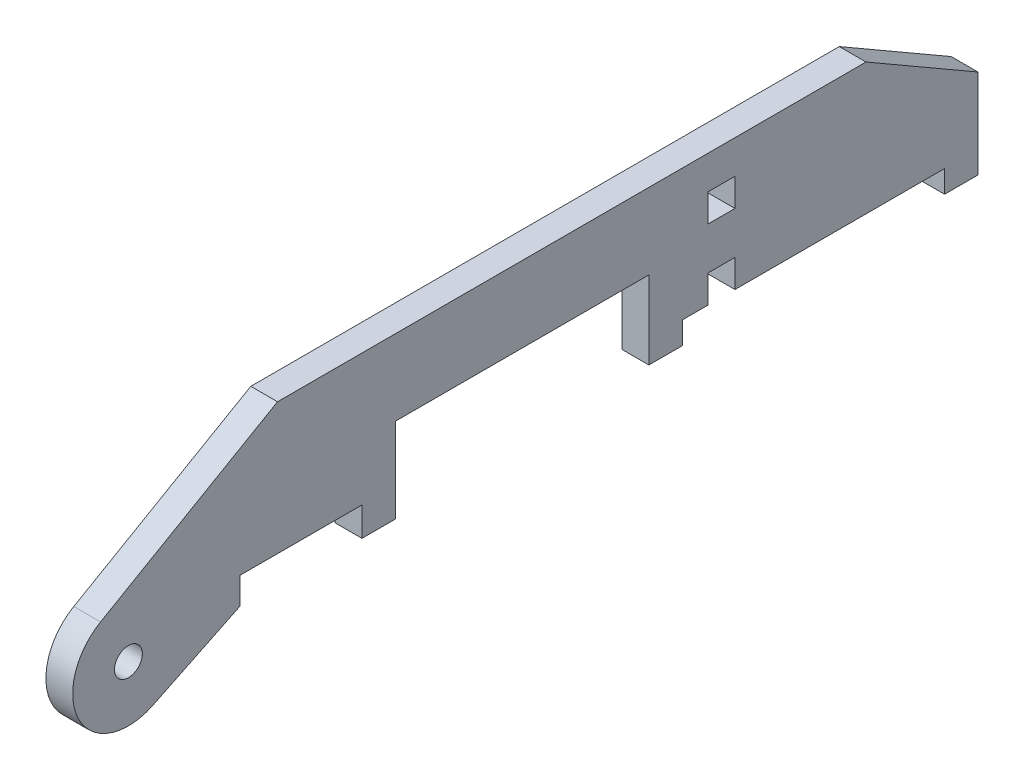
ISO-10303-21;
HEADER;
FILE_DESCRIPTION(('STEP AP214'),'2;1');
FILE_NAME('part.step','',(''),(''),'','','');
FILE_SCHEMA(('AUTOMOTIVE_DESIGN { 1 0 10303 214 1 1 1 1 }'));
ENDSEC;
DATA;
#1=APPLICATION_CONTEXT('core data for automotive mechanical design processes');
#2=APPLICATION_PROTOCOL_DEFINITION('international standard','automotive_design',2000,#1);
#3=PRODUCT_CONTEXT('',#1,'mechanical');
#4=PRODUCT('Part','Part','',(#3));
#5=PRODUCT_RELATED_PRODUCT_CATEGORY('part','',(#4));
#6=PRODUCT_DEFINITION_FORMATION('','',#4);
#7=PRODUCT_DEFINITION_CONTEXT('part definition',#1,'design');
#8=PRODUCT_DEFINITION('design','',#6,#7);
#9=PRODUCT_DEFINITION_SHAPE('','',#8);
#10=(LENGTH_UNIT() NAMED_UNIT(*) SI_UNIT(.MILLI.,.METRE.));
#11=(NAMED_UNIT(*) PLANE_ANGLE_UNIT() SI_UNIT($,.RADIAN.));
#12=(NAMED_UNIT(*) SI_UNIT($,.STERADIAN.) SOLID_ANGLE_UNIT());
#13=UNCERTAINTY_MEASURE_WITH_UNIT(LENGTH_MEASURE(1.E-05),#10,'distance_accuracy_value','');
#14=(GEOMETRIC_REPRESENTATION_CONTEXT(3) GLOBAL_UNCERTAINTY_ASSIGNED_CONTEXT((#13)) GLOBAL_UNIT_ASSIGNED_CONTEXT((#10,
#11,#12)) REPRESENTATION_CONTEXT('',''));
#15=CARTESIAN_POINT('',(0.,0.,0.));
#16=DIRECTION('',(0.,0.,1.));
#17=DIRECTION('',(1.,0.,0.));
#18=AXIS2_PLACEMENT_3D('',#15,#16,#17);
#19=CARTESIAN_POINT('',(3.048,51.3143053538504,147.857292876109));
#20=DIRECTION('',(1.,0.,0.));
#21=DIRECTION('',(0.,0.,-1.));
#22=AXIS2_PLACEMENT_3D('',#19,#20,#21);
#23=PLANE('',#22);
#24=DIRECTION('',(0.,1.,0.));
#25=VECTOR('',#24,1.);
#26=CARTESIAN_POINT('',(3.048,55.626,122.457292876109));
#27=LINE('',#26,#25);
#28=CARTESIAN_POINT('',(3.048,49.53,122.457292876109));
#29=VERTEX_POINT('',#28);
#30=CARTESIAN_POINT('',(3.048,55.626,122.457292876109));
#31=VERTEX_POINT('',#30);
#32=EDGE_CURVE('E248',#29,#31,#27,.T.);
#33=ORIENTED_EDGE('',*,*,#32,.T.);
#34=DIRECTION('',(0.,0.,-1.));
#35=VECTOR('',#34,1.);
#36=CARTESIAN_POINT('',(3.048,55.626,94.6423658094959));
#37=LINE('',#36,#35);
#38=CARTESIAN_POINT('',(3.048,55.626,94.6423658094959));
#39=VERTEX_POINT('',#38);
#40=EDGE_CURVE('E251',#31,#39,#37,.T.);
#41=ORIENTED_EDGE('',*,*,#40,.T.);
#42=DIRECTION('',(0.,-1.,0.));
#43=VECTOR('',#42,1.);
#44=CARTESIAN_POINT('',(3.048,55.626,94.6423658094959));
#45=LINE('',#44,#43);
#46=CARTESIAN_POINT('',(3.048,49.022,94.6423658094959));
#47=VERTEX_POINT('',#46);
#48=EDGE_CURVE('E254',#39,#47,#45,.T.);
#49=ORIENTED_EDGE('',*,*,#48,.T.);
#50=DIRECTION('',(0.,0.,-1.));
#51=VECTOR('',#50,1.);
#52=CARTESIAN_POINT('',(3.048,49.022,87.022365809496));
#53=LINE('',#52,#51);
#54=CARTESIAN_POINT('',(3.048,49.022,87.022365809496));
#55=VERTEX_POINT('',#54);
#56=EDGE_CURVE('E256',#47,#55,#53,.T.);
#57=ORIENTED_EDGE('',*,*,#56,.T.);
#58=DIRECTION('',(0.,1.,0.));
#59=VECTOR('',#58,1.);
#60=CARTESIAN_POINT('',(3.048,49.022,87.022365809496));
#61=LINE('',#60,#59);
#62=CARTESIAN_POINT('',(3.048,68.326,87.022365809496));
#63=VERTEX_POINT('',#62);
#64=EDGE_CURVE('E258',#55,#63,#61,.T.);
#65=ORIENTED_EDGE('',*,*,#64,.T.);
#66=DIRECTION('',(0.,0.,-1.));
#67=VECTOR('',#66,1.);
#68=CARTESIAN_POINT('',(3.048,68.326,87.022365809496));
#69=LINE('',#68,#67);
#70=CARTESIAN_POINT('',(3.048,68.326,29.2718566261337));
#71=VERTEX_POINT('',#70);
#72=EDGE_CURVE('E260',#63,#71,#69,.T.);
#73=ORIENTED_EDGE('',*,*,#72,.T.);
#74=DIRECTION('',(0.,-1.,0.));
#75=VECTOR('',#74,1.);
#76=CARTESIAN_POINT('',(3.048,50.546,29.2718566261337));
#77=LINE('',#76,#75);
#78=CARTESIAN_POINT('',(3.048,50.546,29.2718566261337));
#79=VERTEX_POINT('',#78);
#80=EDGE_CURVE('E262',#71,#79,#77,.T.);
#81=ORIENTED_EDGE('',*,*,#80,.T.);
#82=DIRECTION('',(0.,0.,-1.));
#83=VECTOR('',#82,1.);
#84=CARTESIAN_POINT('',(3.048,50.546,29.2718566261337));
#85=LINE('',#84,#83);
#86=CARTESIAN_POINT('',(3.048,50.546,21.6518566261337));
#87=VERTEX_POINT('',#86);
#88=EDGE_CURVE('E264',#79,#87,#85,.T.);
#89=ORIENTED_EDGE('',*,*,#88,.T.);
#90=DIRECTION('',(0.,1.,0.));
#91=VECTOR('',#90,1.);
#92=CARTESIAN_POINT('',(3.048,55.626,21.6518566261337));
#93=LINE('',#92,#91);
#94=CARTESIAN_POINT('',(3.048,55.626,21.6518566261337));
#95=VERTEX_POINT('',#94);
#96=EDGE_CURVE('E266',#87,#95,#93,.T.);
#97=ORIENTED_EDGE('',*,*,#96,.T.);
#98=DIRECTION('',(0.,0.,-1.));
#99=VECTOR('',#98,1.);
#100=CARTESIAN_POINT('',(3.048,55.626,21.6518566261337));
#101=LINE('',#100,#99);
#102=CARTESIAN_POINT('',(3.048,55.626,15.748));
#103=VERTEX_POINT('',#102);
#104=EDGE_CURVE('E268',#95,#103,#101,.T.);
#105=ORIENTED_EDGE('',*,*,#104,.T.);
#106=DIRECTION('',(0.,1.,0.));
#107=VECTOR('',#106,1.);
#108=CARTESIAN_POINT('',(3.048,55.626,15.748));
#109=LINE('',#108,#107);
#110=CARTESIAN_POINT('',(3.048,61.976,15.748));
#111=VERTEX_POINT('',#110);
#112=EDGE_CURVE('E270',#103,#111,#109,.T.);
#113=ORIENTED_EDGE('',*,*,#112,.T.);
#114=DIRECTION('',(0.,0.,-1.));
#115=VECTOR('',#114,1.);
#116=CARTESIAN_POINT('',(3.048,61.976,15.748));
#117=LINE('',#116,#115);
#118=CARTESIAN_POINT('',(3.048,61.976,9.652));
#119=VERTEX_POINT('',#118);
#120=EDGE_CURVE('E272',#111,#119,#117,.T.);
#121=ORIENTED_EDGE('',*,*,#120,.T.);
#122=DIRECTION('',(0.,-1.,0.));
#123=VECTOR('',#122,1.);
#124=CARTESIAN_POINT('',(3.048,55.626,9.652));
#125=LINE('',#124,#123);
#126=CARTESIAN_POINT('',(3.048,55.626,9.652));
#127=VERTEX_POINT('',#126);
#128=EDGE_CURVE('E274',#119,#127,#125,.T.);
#129=ORIENTED_EDGE('',*,*,#128,.T.);
#130=DIRECTION('',(0.,0.,-1.));
#131=VECTOR('',#130,1.);
#132=CARTESIAN_POINT('',(3.048,55.626,9.652));
#133=LINE('',#132,#131);
#134=CARTESIAN_POINT('',(3.048,55.626,-38.1));
#135=VERTEX_POINT('',#134);
#136=EDGE_CURVE('E276',#127,#135,#133,.T.);
#137=ORIENTED_EDGE('',*,*,#136,.T.);
#138=DIRECTION('',(0.,-1.,0.));
#139=VECTOR('',#138,1.);
#140=CARTESIAN_POINT('',(3.048,55.626,-38.1));
#141=LINE('',#140,#139);
#142=CARTESIAN_POINT('',(3.048,50.546,-38.1));
#143=VERTEX_POINT('',#142);
#144=EDGE_CURVE('E278',#135,#143,#141,.T.);
#145=ORIENTED_EDGE('',*,*,#144,.T.);
#146=DIRECTION('',(0.,0.,-1.));
#147=VECTOR('',#146,1.);
#148=CARTESIAN_POINT('',(3.048,50.546,-45.72));
#149=LINE('',#148,#147);
#150=CARTESIAN_POINT('',(3.048,50.546,-45.72));
#151=VERTEX_POINT('',#150);
#152=EDGE_CURVE('E280',#143,#151,#149,.T.);
#153=ORIENTED_EDGE('',*,*,#152,.T.);
#154=DIRECTION('',(0.,1.,0.));
#155=VECTOR('',#154,1.);
#156=CARTESIAN_POINT('',(3.048,50.546,-45.72));
#157=LINE('',#156,#155);
#158=CARTESIAN_POINT('',(3.048,70.866,-45.72));
#159=VERTEX_POINT('',#158);
#160=EDGE_CURVE('E282',#151,#159,#157,.T.);
#161=ORIENTED_EDGE('',*,*,#160,.T.);
#162=DIRECTION('',(0.,0.500000000000001,0.866025403784438));
#163=VECTOR('',#162,1.);
#164=CARTESIAN_POINT('',(3.048,70.866,-45.72));
#165=LINE('',#164,#163);
#166=CARTESIAN_POINT('',(3.048,85.598,-20.2034275028954));
#167=VERTEX_POINT('',#166);
#168=EDGE_CURVE('E284',#159,#167,#165,.T.);
#169=ORIENTED_EDGE('',*,*,#168,.T.);
#170=DIRECTION('',(0.,0.,1.));
#171=VECTOR('',#170,1.);
#172=CARTESIAN_POINT('',(3.048,85.598,-20.2034275028954));
#173=LINE('',#172,#171);
#174=CARTESIAN_POINT('',(3.048,85.598,113.8761918778));
#175=VERTEX_POINT('',#174);
#176=EDGE_CURVE('E286',#167,#175,#173,.T.);
#177=ORIENTED_EDGE('',*,*,#176,.T.);
#178=DIRECTION('',(0.,-0.499999999999995,0.866025403784441));
#179=VECTOR('',#178,1.);
#180=CARTESIAN_POINT('',(3.048,62.3128279819127,154.207292876109));
#181=LINE('',#180,#179);
#182=CARTESIAN_POINT('',(3.048,62.3128279819127,154.207292876109));
#183=VERTEX_POINT('',#182);
#184=EDGE_CURVE('E288',#175,#183,#181,.T.);
#185=ORIENTED_EDGE('',*,*,#184,.T.);
#186=CARTESIAN_POINT('',(3.048,51.3143053538504,147.857292876109));
#187=DIRECTION('',(1.,0.,0.));
#188=DIRECTION('',(0.,0.,-1.));
#189=AXIS2_PLACEMENT_3D('',#186,#187,#188);
#190=CIRCLE('',#189,12.7);
#191=CARTESIAN_POINT('',(3.048,39.8899589675905,142.309833128914));
#192=VERTEX_POINT('',#191);
#193=EDGE_CURVE('E290',#183,#192,#190,.T.);
#194=ORIENTED_EDGE('',*,*,#193,.T.);
#195=DIRECTION('',(0.,0.436807854109848,-0.899554833563774));
#196=VECTOR('',#195,1.);
#197=CARTESIAN_POINT('',(3.048,49.53,122.457292876109));
#198=LINE('',#197,#196);
#199=EDGE_CURVE('E292',#192,#29,#198,.T.);
#200=ORIENTED_EDGE('',*,*,#199,.T.);
#201=EDGE_LOOP('',(#33,#41,#49,#57,#65,#73,#81,#89,#97,#105,#113,#121,#129,#137,#145,#153,#161,
#169,#177,#185,#194,#200));
#202=FACE_BOUND('',#201,.T.);
#203=CARTESIAN_POINT('',(3.048,51.3143053538504,147.857292876109));
#204=DIRECTION('',(1.,0.,0.));
#205=DIRECTION('',(0.,0.,-1.));
#206=AXIS2_PLACEMENT_3D('',#203,#204,#205);
#207=CIRCLE('',#206,3.17499999999993);
#208=CARTESIAN_POINT('',(3.048,51.3143053538504,144.682292876109));
#209=VERTEX_POINT('',#208);
#210=EDGE_CURVE('E242',#209,#209,#207,.T.);
#211=ORIENTED_EDGE('',*,*,#210,.F.);
#212=EDGE_LOOP('',(#211));
#213=FACE_BOUND('',#212,.T.);
#214=DIRECTION('',(0.,0.,1.));
#215=VECTOR('',#214,1.);
#216=CARTESIAN_POINT('',(3.048,77.978,9.652));
#217=LINE('',#216,#215);
#218=CARTESIAN_POINT('',(3.048,77.978,9.652));
#219=VERTEX_POINT('',#218);
#220=CARTESIAN_POINT('',(3.048,77.978,15.748));
#221=VERTEX_POINT('',#220);
#222=EDGE_CURVE('E214',#219,#221,#217,.T.);
#223=ORIENTED_EDGE('',*,*,#222,.F.);
#224=DIRECTION('',(0.,1.,0.));
#225=VECTOR('',#224,1.);
#226=CARTESIAN_POINT('',(3.048,77.978,9.652));
#227=LINE('',#226,#225);
#228=CARTESIAN_POINT('',(3.048,71.628,9.652));
#229=VERTEX_POINT('',#228);
#230=EDGE_CURVE('E206',#229,#219,#227,.T.);
#231=ORIENTED_EDGE('',*,*,#230,.F.);
#232=DIRECTION('',(0.,0.,-1.));
#233=VECTOR('',#232,1.);
#234=CARTESIAN_POINT('',(3.048,71.628,9.652));
#235=LINE('',#234,#233);
#236=CARTESIAN_POINT('',(3.048,71.628,15.748));
#237=VERTEX_POINT('',#236);
#238=EDGE_CURVE('E228',#237,#229,#235,.T.);
#239=ORIENTED_EDGE('',*,*,#238,.F.);
#240=DIRECTION('',(0.,-1.,0.));
#241=VECTOR('',#240,1.);
#242=CARTESIAN_POINT('',(3.048,77.978,15.748));
#243=LINE('',#242,#241);
#244=EDGE_CURVE('E226',#221,#237,#243,.T.);
#245=ORIENTED_EDGE('',*,*,#244,.F.);
#246=EDGE_LOOP('',(#223,#231,#239,#245));
#247=FACE_BOUND('',#246,.T.);
#248=ADVANCED_FACE('F33',(#202,#213,#247),#23,.T.);
#249=CARTESIAN_POINT('',(-3.048,51.3143053538504,147.857292876109));
#250=DIRECTION('',(1.,0.,0.));
#251=DIRECTION('',(0.,0.,-1.));
#252=AXIS2_PLACEMENT_3D('',#249,#250,#251);
#253=PLANE('',#252);
#254=CARTESIAN_POINT('',(-3.048,51.3143053538504,147.857292876109));
#255=DIRECTION('',(1.,0.,0.));
#256=DIRECTION('',(0.,0.,-1.));
#257=AXIS2_PLACEMENT_3D('',#254,#255,#256);
#258=CIRCLE('',#257,3.17499999999993);
#259=CARTESIAN_POINT('',(-3.048,51.3143053538504,144.682292876109));
#260=VERTEX_POINT('',#259);
#261=EDGE_CURVE('E222',#260,#260,#258,.T.);
#262=ORIENTED_EDGE('',*,*,#261,.T.);
#263=EDGE_LOOP('',(#262));
#264=FACE_BOUND('',#263,.T.);
#265=DIRECTION('',(0.,1.,0.));
#266=VECTOR('',#265,1.);
#267=CARTESIAN_POINT('',(-3.048,55.626,122.457292876109));
#268=LINE('',#267,#266);
#269=CARTESIAN_POINT('',(-3.048,49.53,122.457292876109));
#270=VERTEX_POINT('',#269);
#271=CARTESIAN_POINT('',(-3.048,55.626,122.457292876109));
#272=VERTEX_POINT('',#271);
#273=EDGE_CURVE('E245',#270,#272,#268,.T.);
#274=ORIENTED_EDGE('',*,*,#273,.F.);
#275=DIRECTION('',(0.,0.436807854109848,-0.899554833563774));
#276=VECTOR('',#275,1.);
#277=CARTESIAN_POINT('',(-3.048,49.53,122.457292876109));
#278=LINE('',#277,#276);
#279=CARTESIAN_POINT('',(-3.048,39.8899589675905,142.309833128914));
#280=VERTEX_POINT('',#279);
#281=EDGE_CURVE('E252',#280,#270,#278,.T.);
#282=ORIENTED_EDGE('',*,*,#281,.F.);
#283=CARTESIAN_POINT('',(-3.048,51.3143053538504,147.857292876109));
#284=DIRECTION('',(1.,0.,0.));
#285=DIRECTION('',(0.,0.,-1.));
#286=AXIS2_PLACEMENT_3D('',#283,#284,#285);
#287=CIRCLE('',#286,12.7);
#288=CARTESIAN_POINT('',(-3.048,62.3128279819127,154.207292876109));
#289=VERTEX_POINT('',#288);
#290=EDGE_CURVE('E335',#289,#280,#287,.T.);
#291=ORIENTED_EDGE('',*,*,#290,.F.);
#292=DIRECTION('',(0.,-0.499999999999995,0.866025403784441));
#293=VECTOR('',#292,1.);
#294=CARTESIAN_POINT('',(-3.048,62.3128279819127,154.207292876109));
#295=LINE('',#294,#293);
#296=CARTESIAN_POINT('',(-3.048,85.598,113.8761918778));
#297=VERTEX_POINT('',#296);
#298=EDGE_CURVE('E333',#297,#289,#295,.T.);
#299=ORIENTED_EDGE('',*,*,#298,.F.);
#300=DIRECTION('',(0.,0.,1.));
#301=VECTOR('',#300,1.);
#302=CARTESIAN_POINT('',(-3.048,85.598,-20.2034275028954));
#303=LINE('',#302,#301);
#304=CARTESIAN_POINT('',(-3.048,85.598,-20.2034275028954));
#305=VERTEX_POINT('',#304);
#306=EDGE_CURVE('E331',#305,#297,#303,.T.);
#307=ORIENTED_EDGE('',*,*,#306,.F.);
#308=DIRECTION('',(0.,0.500000000000001,0.866025403784438));
#309=VECTOR('',#308,1.);
#310=CARTESIAN_POINT('',(-3.048,70.866,-45.72));
#311=LINE('',#310,#309);
#312=CARTESIAN_POINT('',(-3.048,70.866,-45.72));
#313=VERTEX_POINT('',#312);
#314=EDGE_CURVE('E329',#313,#305,#311,.T.);
#315=ORIENTED_EDGE('',*,*,#314,.F.);
#316=DIRECTION('',(0.,1.,0.));
#317=VECTOR('',#316,1.);
#318=CARTESIAN_POINT('',(-3.048,50.546,-45.72));
#319=LINE('',#318,#317);
#320=CARTESIAN_POINT('',(-3.048,50.546,-45.72));
#321=VERTEX_POINT('',#320);
#322=EDGE_CURVE('E327',#321,#313,#319,.T.);
#323=ORIENTED_EDGE('',*,*,#322,.F.);
#324=DIRECTION('',(0.,0.,-1.));
#325=VECTOR('',#324,1.);
#326=CARTESIAN_POINT('',(-3.048,50.546,-45.72));
#327=LINE('',#326,#325);
#328=CARTESIAN_POINT('',(-3.048,50.546,-38.1));
#329=VERTEX_POINT('',#328);
#330=EDGE_CURVE('E325',#329,#321,#327,.T.);
#331=ORIENTED_EDGE('',*,*,#330,.F.);
#332=DIRECTION('',(0.,-1.,0.));
#333=VECTOR('',#332,1.);
#334=CARTESIAN_POINT('',(-3.048,55.626,-38.1));
#335=LINE('',#334,#333);
#336=CARTESIAN_POINT('',(-3.048,55.626,-38.1));
#337=VERTEX_POINT('',#336);
#338=EDGE_CURVE('E323',#337,#329,#335,.T.);
#339=ORIENTED_EDGE('',*,*,#338,.F.);
#340=DIRECTION('',(0.,0.,-1.));
#341=VECTOR('',#340,1.);
#342=CARTESIAN_POINT('',(-3.048,55.626,9.652));
#343=LINE('',#342,#341);
#344=CARTESIAN_POINT('',(-3.048,55.626,9.652));
#345=VERTEX_POINT('',#344);
#346=EDGE_CURVE('E321',#345,#337,#343,.T.);
#347=ORIENTED_EDGE('',*,*,#346,.F.);
#348=DIRECTION('',(0.,-1.,0.));
#349=VECTOR('',#348,1.);
#350=CARTESIAN_POINT('',(-3.048,55.626,9.652));
#351=LINE('',#350,#349);
#352=CARTESIAN_POINT('',(-3.048,61.976,9.652));
#353=VERTEX_POINT('',#352);
#354=EDGE_CURVE('E319',#353,#345,#351,.T.);
#355=ORIENTED_EDGE('',*,*,#354,.F.);
#356=DIRECTION('',(0.,0.,-1.));
#357=VECTOR('',#356,1.);
#358=CARTESIAN_POINT('',(-3.048,61.976,15.748));
#359=LINE('',#358,#357);
#360=CARTESIAN_POINT('',(-3.048,61.976,15.748));
#361=VERTEX_POINT('',#360);
#362=EDGE_CURVE('E317',#361,#353,#359,.T.);
#363=ORIENTED_EDGE('',*,*,#362,.F.);
#364=DIRECTION('',(0.,1.,0.));
#365=VECTOR('',#364,1.);
#366=CARTESIAN_POINT('',(-3.048,55.626,15.748));
#367=LINE('',#366,#365);
#368=CARTESIAN_POINT('',(-3.048,55.626,15.748));
#369=VERTEX_POINT('',#368);
#370=EDGE_CURVE('E315',#369,#361,#367,.T.);
#371=ORIENTED_EDGE('',*,*,#370,.F.);
#372=DIRECTION('',(0.,0.,-1.));
#373=VECTOR('',#372,1.);
#374=CARTESIAN_POINT('',(-3.048,55.626,21.6518566261337));
#375=LINE('',#374,#373);
#376=CARTESIAN_POINT('',(-3.048,55.626,21.6518566261337));
#377=VERTEX_POINT('',#376);
#378=EDGE_CURVE('E313',#377,#369,#375,.T.);
#379=ORIENTED_EDGE('',*,*,#378,.F.);
#380=DIRECTION('',(0.,1.,0.));
#381=VECTOR('',#380,1.);
#382=CARTESIAN_POINT('',(-3.048,55.626,21.6518566261337));
#383=LINE('',#382,#381);
#384=CARTESIAN_POINT('',(-3.048,50.546,21.6518566261337));
#385=VERTEX_POINT('',#384);
#386=EDGE_CURVE('E311',#385,#377,#383,.T.);
#387=ORIENTED_EDGE('',*,*,#386,.F.);
#388=DIRECTION('',(0.,0.,-1.));
#389=VECTOR('',#388,1.);
#390=CARTESIAN_POINT('',(-3.048,50.546,29.2718566261337));
#391=LINE('',#390,#389);
#392=CARTESIAN_POINT('',(-3.048,50.546,29.2718566261337));
#393=VERTEX_POINT('',#392);
#394=EDGE_CURVE('E309',#393,#385,#391,.T.);
#395=ORIENTED_EDGE('',*,*,#394,.F.);
#396=DIRECTION('',(0.,-1.,0.));
#397=VECTOR('',#396,1.);
#398=CARTESIAN_POINT('',(-3.048,50.546,29.2718566261337));
#399=LINE('',#398,#397);
#400=CARTESIAN_POINT('',(-3.048,68.326,29.2718566261337));
#401=VERTEX_POINT('',#400);
#402=EDGE_CURVE('E307',#401,#393,#399,.T.);
#403=ORIENTED_EDGE('',*,*,#402,.F.);
#404=DIRECTION('',(0.,0.,-1.));
#405=VECTOR('',#404,1.);
#406=CARTESIAN_POINT('',(-3.048,68.326,87.022365809496));
#407=LINE('',#406,#405);
#408=CARTESIAN_POINT('',(-3.048,68.326,87.022365809496));
#409=VERTEX_POINT('',#408);
#410=EDGE_CURVE('E305',#409,#401,#407,.T.);
#411=ORIENTED_EDGE('',*,*,#410,.F.);
#412=DIRECTION('',(0.,1.,0.));
#413=VECTOR('',#412,1.);
#414=CARTESIAN_POINT('',(-3.048,49.022,87.022365809496));
#415=LINE('',#414,#413);
#416=CARTESIAN_POINT('',(-3.048,49.022,87.022365809496));
#417=VERTEX_POINT('',#416);
#418=EDGE_CURVE('E303',#417,#409,#415,.T.);
#419=ORIENTED_EDGE('',*,*,#418,.F.);
#420=DIRECTION('',(0.,0.,-1.));
#421=VECTOR('',#420,1.);
#422=CARTESIAN_POINT('',(-3.048,49.022,87.022365809496));
#423=LINE('',#422,#421);
#424=CARTESIAN_POINT('',(-3.048,49.022,94.6423658094959));
#425=VERTEX_POINT('',#424);
#426=EDGE_CURVE('E301',#425,#417,#423,.T.);
#427=ORIENTED_EDGE('',*,*,#426,.F.);
#428=DIRECTION('',(0.,-1.,0.));
#429=VECTOR('',#428,1.);
#430=CARTESIAN_POINT('',(-3.048,55.626,94.6423658094959));
#431=LINE('',#430,#429);
#432=CARTESIAN_POINT('',(-3.048,55.626,94.6423658094959));
#433=VERTEX_POINT('',#432);
#434=EDGE_CURVE('E299',#433,#425,#431,.T.);
#435=ORIENTED_EDGE('',*,*,#434,.F.);
#436=DIRECTION('',(0.,0.,-1.));
#437=VECTOR('',#436,1.);
#438=CARTESIAN_POINT('',(-3.048,55.626,94.6423658094959));
#439=LINE('',#438,#437);
#440=EDGE_CURVE('E297',#272,#433,#439,.T.);
#441=ORIENTED_EDGE('',*,*,#440,.F.);
#442=EDGE_LOOP('',(#274,#282,#291,#299,#307,#315,#323,#331,#339,#347,#355,#363,#371,#379,#387,
#395,#403,#411,#419,#427,#435,#441));
#443=FACE_BOUND('',#442,.T.);
#444=DIRECTION('',(0.,1.,0.));
#445=VECTOR('',#444,1.);
#446=CARTESIAN_POINT('',(-3.048,77.978,9.652));
#447=LINE('',#446,#445);
#448=CARTESIAN_POINT('',(-3.048,71.628,9.65199999999999));
#449=VERTEX_POINT('',#448);
#450=CARTESIAN_POINT('',(-3.048,77.978,9.652));
#451=VERTEX_POINT('',#450);
#452=EDGE_CURVE('E56',#449,#451,#447,.T.);
#453=ORIENTED_EDGE('',*,*,#452,.T.);
#454=DIRECTION('',(0.,0.,1.));
#455=VECTOR('',#454,1.);
#456=CARTESIAN_POINT('',(-3.048,77.978,9.652));
#457=LINE('',#456,#455);
#458=CARTESIAN_POINT('',(-3.048,77.978,15.748));
#459=VERTEX_POINT('',#458);
#460=EDGE_CURVE('E221',#451,#459,#457,.T.);
#461=ORIENTED_EDGE('',*,*,#460,.T.);
#462=DIRECTION('',(0.,-1.,0.));
#463=VECTOR('',#462,1.);
#464=CARTESIAN_POINT('',(-3.048,77.978,15.748));
#465=LINE('',#464,#463);
#466=CARTESIAN_POINT('',(-3.048,71.628,15.748));
#467=VERTEX_POINT('',#466);
#468=EDGE_CURVE('E234',#459,#467,#465,.T.);
#469=ORIENTED_EDGE('',*,*,#468,.T.);
#470=DIRECTION('',(0.,0.,-1.));
#471=VECTOR('',#470,1.);
#472=CARTESIAN_POINT('',(-3.048,71.628,9.652));
#473=LINE('',#472,#471);
#474=EDGE_CURVE('E215',#467,#449,#473,.T.);
#475=ORIENTED_EDGE('',*,*,#474,.T.);
#476=EDGE_LOOP('',(#453,#461,#469,#475));
#477=FACE_BOUND('',#476,.T.);
#478=ADVANCED_FACE('F407',(#264,#443,#477),#253,.F.);
#479=CARTESIAN_POINT('',(3.048,55.626,122.457292876109));
#480=DIRECTION('',(0.,0.,1.));
#481=DIRECTION('',(1.,0.,0.));
#482=AXIS2_PLACEMENT_3D('',#479,#480,#481);
#483=PLANE('',#482);
#484=ORIENTED_EDGE('',*,*,#273,.T.);
#485=DIRECTION('',(-1.,0.,0.));
#486=VECTOR('',#485,1.);
#487=CARTESIAN_POINT('',(3.048,55.626,122.457292876109));
#488=LINE('',#487,#486);
#489=EDGE_CURVE('E11',#31,#272,#488,.T.);
#490=ORIENTED_EDGE('',*,*,#489,.F.);
#491=ORIENTED_EDGE('',*,*,#32,.F.);
#492=DIRECTION('',(-1.,0.,0.));
#493=VECTOR('',#492,1.);
#494=CARTESIAN_POINT('',(3.048,49.53,122.457292876109));
#495=LINE('',#494,#493);
#496=EDGE_CURVE('E294',#29,#270,#495,.T.);
#497=ORIENTED_EDGE('',*,*,#496,.T.);
#498=EDGE_LOOP('',(#484,#490,#491,#497));
#499=FACE_BOUND('',#498,.T.);
#500=ADVANCED_FACE('F35',(#499),#483,.F.);
#501=CARTESIAN_POINT('',(3.048,55.626,94.6423658094959));
#502=DIRECTION('',(0.,1.,0.));
#503=DIRECTION('',(0.,0.,1.));
#504=AXIS2_PLACEMENT_3D('',#501,#502,#503);
#505=PLANE('',#504);
#506=ORIENTED_EDGE('',*,*,#440,.T.);
#507=DIRECTION('',(-1.,0.,0.));
#508=VECTOR('',#507,1.);
#509=CARTESIAN_POINT('',(3.048,55.626,94.6423658094959));
#510=LINE('',#509,#508);
#511=EDGE_CURVE('E41',#39,#433,#510,.T.);
#512=ORIENTED_EDGE('',*,*,#511,.F.);
#513=ORIENTED_EDGE('',*,*,#40,.F.);
#514=ORIENTED_EDGE('',*,*,#489,.T.);
#515=EDGE_LOOP('',(#506,#512,#513,#514));
#516=FACE_BOUND('',#515,.T.);
#517=ADVANCED_FACE('F425',(#516),#505,.F.);
#518=CARTESIAN_POINT('',(3.048,55.626,94.6423658094959));
#519=DIRECTION('',(0.,0.,-1.));
#520=DIRECTION('',(-1.,0.,0.));
#521=AXIS2_PLACEMENT_3D('',#518,#519,#520);
#522=PLANE('',#521);
#523=ORIENTED_EDGE('',*,*,#434,.T.);
#524=DIRECTION('',(-1.,0.,0.));
#525=VECTOR('',#524,1.);
#526=CARTESIAN_POINT('',(3.048,49.022,94.6423658094959));
#527=LINE('',#526,#525);
#528=EDGE_CURVE('E394',#47,#425,#527,.T.);
#529=ORIENTED_EDGE('',*,*,#528,.F.);
#530=ORIENTED_EDGE('',*,*,#48,.F.);
#531=ORIENTED_EDGE('',*,*,#511,.T.);
#532=EDGE_LOOP('',(#523,#529,#530,#531));
#533=FACE_BOUND('',#532,.T.);
#534=ADVANCED_FACE('F401',(#533),#522,.F.);
#535=CARTESIAN_POINT('',(3.048,49.022,87.022365809496));
#536=DIRECTION('',(0.,1.,0.));
#537=DIRECTION('',(0.,0.,1.));
#538=AXIS2_PLACEMENT_3D('',#535,#536,#537);
#539=PLANE('',#538);
#540=ORIENTED_EDGE('',*,*,#426,.T.);
#541=DIRECTION('',(-1.,0.,0.));
#542=VECTOR('',#541,1.);
#543=CARTESIAN_POINT('',(3.048,49.022,87.022365809496));
#544=LINE('',#543,#542);
#545=EDGE_CURVE('E391',#55,#417,#544,.T.);
#546=ORIENTED_EDGE('',*,*,#545,.F.);
#547=ORIENTED_EDGE('',*,*,#56,.F.);
#548=ORIENTED_EDGE('',*,*,#528,.T.);
#549=EDGE_LOOP('',(#540,#546,#547,#548));
#550=FACE_BOUND('',#549,.T.);
#551=ADVANCED_FACE('F413',(#550),#539,.F.);
#552=CARTESIAN_POINT('',(3.048,49.022,87.022365809496));
#553=DIRECTION('',(0.,0.,1.));
#554=DIRECTION('',(1.,0.,0.));
#555=AXIS2_PLACEMENT_3D('',#552,#553,#554);
#556=PLANE('',#555);
#557=ORIENTED_EDGE('',*,*,#418,.T.);
#558=DIRECTION('',(-1.,0.,0.));
#559=VECTOR('',#558,1.);
#560=CARTESIAN_POINT('',(3.048,68.326,87.022365809496));
#561=LINE('',#560,#559);
#562=EDGE_CURVE('E388',#63,#409,#561,.T.);
#563=ORIENTED_EDGE('',*,*,#562,.F.);
#564=ORIENTED_EDGE('',*,*,#64,.F.);
#565=ORIENTED_EDGE('',*,*,#545,.T.);
#566=EDGE_LOOP('',(#557,#563,#564,#565));
#567=FACE_BOUND('',#566,.T.);
#568=ADVANCED_FACE('F417',(#567),#556,.F.);
#569=CARTESIAN_POINT('',(3.048,68.326,87.022365809496));
#570=DIRECTION('',(0.,1.,0.));
#571=DIRECTION('',(0.,0.,1.));
#572=AXIS2_PLACEMENT_3D('',#569,#570,#571);
#573=PLANE('',#572);
#574=ORIENTED_EDGE('',*,*,#410,.T.);
#575=DIRECTION('',(-1.,0.,0.));
#576=VECTOR('',#575,1.);
#577=CARTESIAN_POINT('',(3.048,68.326,29.2718566261337));
#578=LINE('',#577,#576);
#579=EDGE_CURVE('E385',#71,#401,#578,.T.);
#580=ORIENTED_EDGE('',*,*,#579,.F.);
#581=ORIENTED_EDGE('',*,*,#72,.F.);
#582=ORIENTED_EDGE('',*,*,#562,.T.);
#583=EDGE_LOOP('',(#574,#580,#581,#582));
#584=FACE_BOUND('',#583,.T.);
#585=ADVANCED_FACE('F508',(#584),#573,.F.);
#586=CARTESIAN_POINT('',(3.048,50.546,29.2718566261337));
#587=DIRECTION('',(0.,0.,-1.));
#588=DIRECTION('',(-1.,0.,0.));
#589=AXIS2_PLACEMENT_3D('',#586,#587,#588);
#590=PLANE('',#589);
#591=ORIENTED_EDGE('',*,*,#402,.T.);
#592=DIRECTION('',(-1.,0.,0.));
#593=VECTOR('',#592,1.);
#594=CARTESIAN_POINT('',(3.048,50.546,29.2718566261337));
#595=LINE('',#594,#593);
#596=EDGE_CURVE('E382',#79,#393,#595,.T.);
#597=ORIENTED_EDGE('',*,*,#596,.F.);
#598=ORIENTED_EDGE('',*,*,#80,.F.);
#599=ORIENTED_EDGE('',*,*,#579,.T.);
#600=EDGE_LOOP('',(#591,#597,#598,#599));
#601=FACE_BOUND('',#600,.T.);
#602=ADVANCED_FACE('F505',(#601),#590,.F.);
#603=CARTESIAN_POINT('',(3.048,50.546,29.2718566261337));
#604=DIRECTION('',(0.,1.,0.));
#605=DIRECTION('',(0.,0.,1.));
#606=AXIS2_PLACEMENT_3D('',#603,#604,#605);
#607=PLANE('',#606);
#608=ORIENTED_EDGE('',*,*,#394,.T.);
#609=DIRECTION('',(-1.,0.,0.));
#610=VECTOR('',#609,1.);
#611=CARTESIAN_POINT('',(3.048,50.546,21.6518566261337));
#612=LINE('',#611,#610);
#613=EDGE_CURVE('E379',#87,#385,#612,.T.);
#614=ORIENTED_EDGE('',*,*,#613,.F.);
#615=ORIENTED_EDGE('',*,*,#88,.F.);
#616=ORIENTED_EDGE('',*,*,#596,.T.);
#617=EDGE_LOOP('',(#608,#614,#615,#616));
#618=FACE_BOUND('',#617,.T.);
#619=ADVANCED_FACE('F501',(#618),#607,.F.);
#620=CARTESIAN_POINT('',(3.048,55.626,21.6518566261337));
#621=DIRECTION('',(0.,0.,1.));
#622=DIRECTION('',(1.,0.,0.));
#623=AXIS2_PLACEMENT_3D('',#620,#621,#622);
#624=PLANE('',#623);
#625=ORIENTED_EDGE('',*,*,#386,.T.);
#626=DIRECTION('',(-1.,0.,0.));
#627=VECTOR('',#626,1.);
#628=CARTESIAN_POINT('',(3.048,55.626,21.6518566261337));
#629=LINE('',#628,#627);
#630=EDGE_CURVE('E376',#95,#377,#629,.T.);
#631=ORIENTED_EDGE('',*,*,#630,.F.);
#632=ORIENTED_EDGE('',*,*,#96,.F.);
#633=ORIENTED_EDGE('',*,*,#613,.T.);
#634=EDGE_LOOP('',(#625,#631,#632,#633));
#635=FACE_BOUND('',#634,.T.);
#636=ADVANCED_FACE('F497',(#635),#624,.F.);
#637=CARTESIAN_POINT('',(3.048,55.626,21.6518566261337));
#638=DIRECTION('',(0.,1.,0.));
#639=DIRECTION('',(0.,0.,1.));
#640=AXIS2_PLACEMENT_3D('',#637,#638,#639);
#641=PLANE('',#640);
#642=ORIENTED_EDGE('',*,*,#378,.T.);
#643=DIRECTION('',(-1.,0.,0.));
#644=VECTOR('',#643,1.);
#645=CARTESIAN_POINT('',(3.048,55.626,15.748));
#646=LINE('',#645,#644);
#647=EDGE_CURVE('E373',#103,#369,#646,.T.);
#648=ORIENTED_EDGE('',*,*,#647,.F.);
#649=ORIENTED_EDGE('',*,*,#104,.F.);
#650=ORIENTED_EDGE('',*,*,#630,.T.);
#651=EDGE_LOOP('',(#642,#648,#649,#650));
#652=FACE_BOUND('',#651,.T.);
#653=ADVANCED_FACE('F492',(#652),#641,.F.);
#654=CARTESIAN_POINT('',(3.048,55.626,15.748));
#655=DIRECTION('',(0.,0.,1.));
#656=DIRECTION('',(1.,0.,0.));
#657=AXIS2_PLACEMENT_3D('',#654,#655,#656);
#658=PLANE('',#657);
#659=ORIENTED_EDGE('',*,*,#370,.T.);
#660=DIRECTION('',(-1.,0.,0.));
#661=VECTOR('',#660,1.);
#662=CARTESIAN_POINT('',(3.048,61.976,15.748));
#663=LINE('',#662,#661);
#664=EDGE_CURVE('E370',#111,#361,#663,.T.);
#665=ORIENTED_EDGE('',*,*,#664,.F.);
#666=ORIENTED_EDGE('',*,*,#112,.F.);
#667=ORIENTED_EDGE('',*,*,#647,.T.);
#668=EDGE_LOOP('',(#659,#665,#666,#667));
#669=FACE_BOUND('',#668,.T.);
#670=ADVANCED_FACE('F486',(#669),#658,.F.);
#671=CARTESIAN_POINT('',(3.048,61.976,15.748));
#672=DIRECTION('',(0.,1.,0.));
#673=DIRECTION('',(0.,0.,1.));
#674=AXIS2_PLACEMENT_3D('',#671,#672,#673);
#675=PLANE('',#674);
#676=ORIENTED_EDGE('',*,*,#362,.T.);
#677=DIRECTION('',(-1.,0.,0.));
#678=VECTOR('',#677,1.);
#679=CARTESIAN_POINT('',(3.048,61.976,9.652));
#680=LINE('',#679,#678);
#681=EDGE_CURVE('E367',#119,#353,#680,.T.);
#682=ORIENTED_EDGE('',*,*,#681,.F.);
#683=ORIENTED_EDGE('',*,*,#120,.F.);
#684=ORIENTED_EDGE('',*,*,#664,.T.);
#685=EDGE_LOOP('',(#676,#682,#683,#684));
#686=FACE_BOUND('',#685,.T.);
#687=ADVANCED_FACE('F482',(#686),#675,.F.);
#688=CARTESIAN_POINT('',(3.048,55.626,9.652));
#689=DIRECTION('',(0.,0.,-1.));
#690=DIRECTION('',(-1.,0.,0.));
#691=AXIS2_PLACEMENT_3D('',#688,#689,#690);
#692=PLANE('',#691);
#693=ORIENTED_EDGE('',*,*,#354,.T.);
#694=DIRECTION('',(-1.,0.,0.));
#695=VECTOR('',#694,1.);
#696=CARTESIAN_POINT('',(3.048,55.626,9.652));
#697=LINE('',#696,#695);
#698=EDGE_CURVE('E364',#127,#345,#697,.T.);
#699=ORIENTED_EDGE('',*,*,#698,.F.);
#700=ORIENTED_EDGE('',*,*,#128,.F.);
#701=ORIENTED_EDGE('',*,*,#681,.T.);
#702=EDGE_LOOP('',(#693,#699,#700,#701));
#703=FACE_BOUND('',#702,.T.);
#704=ADVANCED_FACE('F477',(#703),#692,.F.);
#705=CARTESIAN_POINT('',(3.048,55.626,9.652));
#706=DIRECTION('',(0.,1.,0.));
#707=DIRECTION('',(0.,0.,1.));
#708=AXIS2_PLACEMENT_3D('',#705,#706,#707);
#709=PLANE('',#708);
#710=ORIENTED_EDGE('',*,*,#346,.T.);
#711=DIRECTION('',(-1.,0.,0.));
#712=VECTOR('',#711,1.);
#713=CARTESIAN_POINT('',(3.048,55.626,-38.1));
#714=LINE('',#713,#712);
#715=EDGE_CURVE('E361',#135,#337,#714,.T.);
#716=ORIENTED_EDGE('',*,*,#715,.F.);
#717=ORIENTED_EDGE('',*,*,#136,.F.);
#718=ORIENTED_EDGE('',*,*,#698,.T.);
#719=EDGE_LOOP('',(#710,#716,#717,#718));
#720=FACE_BOUND('',#719,.T.);
#721=ADVANCED_FACE('F471',(#720),#709,.F.);
#722=CARTESIAN_POINT('',(3.048,55.626,-38.1));
#723=DIRECTION('',(0.,0.,-1.));
#724=DIRECTION('',(0.,1.,0.));
#725=AXIS2_PLACEMENT_3D('',#722,#723,#724);
#726=PLANE('',#725);
#727=ORIENTED_EDGE('',*,*,#338,.T.);
#728=DIRECTION('',(-1.,0.,0.));
#729=VECTOR('',#728,1.);
#730=CARTESIAN_POINT('',(3.048,50.546,-38.1));
#731=LINE('',#730,#729);
#732=EDGE_CURVE('E358',#143,#329,#731,.T.);
#733=ORIENTED_EDGE('',*,*,#732,.F.);
#734=ORIENTED_EDGE('',*,*,#144,.F.);
#735=ORIENTED_EDGE('',*,*,#715,.T.);
#736=EDGE_LOOP('',(#727,#733,#734,#735));
#737=FACE_BOUND('',#736,.T.);
#738=ADVANCED_FACE('F467',(#737),#726,.F.);
#739=CARTESIAN_POINT('',(3.048,50.546,-45.72));
#740=DIRECTION('',(0.,1.,0.));
#741=DIRECTION('',(0.,0.,1.));
#742=AXIS2_PLACEMENT_3D('',#739,#740,#741);
#743=PLANE('',#742);
#744=ORIENTED_EDGE('',*,*,#330,.T.);
#745=DIRECTION('',(-1.,0.,0.));
#746=VECTOR('',#745,1.);
#747=CARTESIAN_POINT('',(3.048,50.546,-45.72));
#748=LINE('',#747,#746);
#749=EDGE_CURVE('E355',#151,#321,#748,.T.);
#750=ORIENTED_EDGE('',*,*,#749,.F.);
#751=ORIENTED_EDGE('',*,*,#152,.F.);
#752=ORIENTED_EDGE('',*,*,#732,.T.);
#753=EDGE_LOOP('',(#744,#750,#751,#752));
#754=FACE_BOUND('',#753,.T.);
#755=ADVANCED_FACE('F462',(#754),#743,.F.);
#756=CARTESIAN_POINT('',(3.048,50.546,-45.72));
#757=DIRECTION('',(0.,0.,1.));
#758=DIRECTION('',(0.,-1.,0.));
#759=AXIS2_PLACEMENT_3D('',#756,#757,#758);
#760=PLANE('',#759);
#761=ORIENTED_EDGE('',*,*,#322,.T.);
#762=DIRECTION('',(-1.,0.,0.));
#763=VECTOR('',#762,1.);
#764=CARTESIAN_POINT('',(3.048,70.866,-45.72));
#765=LINE('',#764,#763);
#766=EDGE_CURVE('E352',#159,#313,#765,.T.);
#767=ORIENTED_EDGE('',*,*,#766,.F.);
#768=ORIENTED_EDGE('',*,*,#160,.F.);
#769=ORIENTED_EDGE('',*,*,#749,.T.);
#770=EDGE_LOOP('',(#761,#767,#768,#769));
#771=FACE_BOUND('',#770,.T.);
#772=ADVANCED_FACE('F456',(#771),#760,.F.);
#773=CARTESIAN_POINT('',(3.048,70.866,-45.72));
#774=DIRECTION('',(0.,-0.866025403784438,0.500000000000001));
#775=DIRECTION('',(0.,-0.500000000000001,-0.866025403784438));
#776=AXIS2_PLACEMENT_3D('',#773,#774,#775);
#777=PLANE('',#776);
#778=ORIENTED_EDGE('',*,*,#314,.T.);
#779=DIRECTION('',(-1.,0.,0.));
#780=VECTOR('',#779,1.);
#781=CARTESIAN_POINT('',(3.048,85.598,-20.2034275028954));
#782=LINE('',#781,#780);
#783=EDGE_CURVE('E349',#167,#305,#782,.T.);
#784=ORIENTED_EDGE('',*,*,#783,.F.);
#785=ORIENTED_EDGE('',*,*,#168,.F.);
#786=ORIENTED_EDGE('',*,*,#766,.T.);
#787=EDGE_LOOP('',(#778,#784,#785,#786));
#788=FACE_BOUND('',#787,.T.);
#789=ADVANCED_FACE('F452',(#788),#777,.F.);
#790=CARTESIAN_POINT('',(3.048,85.598,-20.2034275028954));
#791=DIRECTION('',(0.,-1.,0.));
#792=DIRECTION('',(0.,0.,-1.));
#793=AXIS2_PLACEMENT_3D('',#790,#791,#792);
#794=PLANE('',#793);
#795=ORIENTED_EDGE('',*,*,#306,.T.);
#796=DIRECTION('',(-1.,0.,0.));
#797=VECTOR('',#796,1.);
#798=CARTESIAN_POINT('',(3.048,85.598,113.8761918778));
#799=LINE('',#798,#797);
#800=EDGE_CURVE('E346',#175,#297,#799,.T.);
#801=ORIENTED_EDGE('',*,*,#800,.F.);
#802=ORIENTED_EDGE('',*,*,#176,.F.);
#803=ORIENTED_EDGE('',*,*,#783,.T.);
#804=EDGE_LOOP('',(#795,#801,#802,#803));
#805=FACE_BOUND('',#804,.T.);
#806=ADVANCED_FACE('F447',(#805),#794,.F.);
#807=CARTESIAN_POINT('',(3.048,62.3128279819127,154.207292876109));
#808=DIRECTION('',(0.,-0.866025403784441,-0.499999999999995));
#809=DIRECTION('',(0.,0.499999999999995,-0.866025403784441));
#810=AXIS2_PLACEMENT_3D('',#807,#808,#809);
#811=PLANE('',#810);
#812=ORIENTED_EDGE('',*,*,#298,.T.);
#813=DIRECTION('',(-1.,0.,0.));
#814=VECTOR('',#813,1.);
#815=CARTESIAN_POINT('',(3.048,62.3128279819127,154.207292876109));
#816=LINE('',#815,#814);
#817=EDGE_CURVE('E343',#183,#289,#816,.T.);
#818=ORIENTED_EDGE('',*,*,#817,.F.);
#819=ORIENTED_EDGE('',*,*,#184,.F.);
#820=ORIENTED_EDGE('',*,*,#800,.T.);
#821=EDGE_LOOP('',(#812,#818,#819,#820));
#822=FACE_BOUND('',#821,.T.);
#823=ADVANCED_FACE('F441',(#822),#811,.F.);
#824=CARTESIAN_POINT('',(3.048,51.3143053538504,147.857292876109));
#825=DIRECTION('',(-1.,0.,0.));
#826=DIRECTION('',(0.,0.,1.));
#827=AXIS2_PLACEMENT_3D('',#824,#825,#826);
#828=CYLINDRICAL_SURFACE('',#827,12.7);
#829=ORIENTED_EDGE('',*,*,#290,.T.);
#830=DIRECTION('',(-1.,0.,0.));
#831=VECTOR('',#830,1.);
#832=CARTESIAN_POINT('',(3.048,39.8899589675905,142.309833128914));
#833=LINE('',#832,#831);
#834=EDGE_CURVE('E340',#192,#280,#833,.T.);
#835=ORIENTED_EDGE('',*,*,#834,.F.);
#836=ORIENTED_EDGE('',*,*,#193,.F.);
#837=ORIENTED_EDGE('',*,*,#817,.T.);
#838=EDGE_LOOP('',(#829,#835,#836,#837));
#839=FACE_BOUND('',#838,.T.);
#840=ADVANCED_FACE('F437',(#839),#828,.T.);
#841=CARTESIAN_POINT('',(3.048,49.53,122.457292876109));
#842=DIRECTION('',(0.,0.899554833563774,0.436807854109848));
#843=DIRECTION('',(0.,-0.436807854109848,0.899554833563774));
#844=AXIS2_PLACEMENT_3D('',#841,#842,#843);
#845=PLANE('',#844);
#846=ORIENTED_EDGE('',*,*,#281,.T.);
#847=ORIENTED_EDGE('',*,*,#496,.F.);
#848=ORIENTED_EDGE('',*,*,#199,.F.);
#849=ORIENTED_EDGE('',*,*,#834,.T.);
#850=EDGE_LOOP('',(#846,#847,#848,#849));
#851=FACE_BOUND('',#850,.T.);
#852=ADVANCED_FACE('F432',(#851),#845,.F.);
#853=CARTESIAN_POINT('',(3.048,51.3143053538504,147.857292876109));
#854=DIRECTION('',(-1.,0.,0.));
#855=DIRECTION('',(0.,0.,1.));
#856=AXIS2_PLACEMENT_3D('',#853,#854,#855);
#857=CYLINDRICAL_SURFACE('',#856,3.17499999999993);
#858=ORIENTED_EDGE('',*,*,#210,.T.);
#859=EDGE_LOOP('',(#858));
#860=FACE_BOUND('',#859,.T.);
#861=ORIENTED_EDGE('',*,*,#261,.F.);
#862=EDGE_LOOP('',(#861));
#863=FACE_BOUND('',#862,.T.);
#864=ADVANCED_FACE('F525',(#860,#863),#857,.F.);
#865=CARTESIAN_POINT('',(3.048,77.978,9.652));
#866=DIRECTION('',(0.,0.,1.));
#867=DIRECTION('',(0.,-1.,0.));
#868=AXIS2_PLACEMENT_3D('',#865,#866,#867);
#869=PLANE('',#868);
#870=ORIENTED_EDGE('',*,*,#452,.F.);
#871=DIRECTION('',(-1.,0.,0.));
#872=VECTOR('',#871,1.);
#873=CARTESIAN_POINT('',(3.048,71.628,9.652));
#874=LINE('',#873,#872);
#875=EDGE_CURVE('E210',#229,#449,#874,.T.);
#876=ORIENTED_EDGE('',*,*,#875,.F.);
#877=ORIENTED_EDGE('',*,*,#230,.T.);
#878=DIRECTION('',(-1.,0.,0.));
#879=VECTOR('',#878,1.);
#880=CARTESIAN_POINT('',(3.048,77.978,9.652));
#881=LINE('',#880,#879);
#882=EDGE_CURVE('E209',#219,#451,#881,.T.);
#883=ORIENTED_EDGE('',*,*,#882,.T.);
#884=EDGE_LOOP('',(#870,#876,#877,#883));
#885=FACE_BOUND('',#884,.T.);
#886=ADVANCED_FACE('F208',(#885),#869,.T.);
#887=CARTESIAN_POINT('',(3.048,77.978,9.652));
#888=DIRECTION('',(0.,-1.,0.));
#889=DIRECTION('',(0.,0.,-1.));
#890=AXIS2_PLACEMENT_3D('',#887,#888,#889);
#891=PLANE('',#890);
#892=ORIENTED_EDGE('',*,*,#460,.F.);
#893=ORIENTED_EDGE('',*,*,#882,.F.);
#894=ORIENTED_EDGE('',*,*,#222,.T.);
#895=DIRECTION('',(-1.,0.,0.));
#896=VECTOR('',#895,1.);
#897=CARTESIAN_POINT('',(3.048,77.978,15.748));
#898=LINE('',#897,#896);
#899=EDGE_CURVE('E223',#221,#459,#898,.T.);
#900=ORIENTED_EDGE('',*,*,#899,.T.);
#901=EDGE_LOOP('',(#892,#893,#894,#900));
#902=FACE_BOUND('',#901,.T.);
#903=ADVANCED_FACE('F218',(#902),#891,.T.);
#904=CARTESIAN_POINT('',(3.048,77.978,15.748));
#905=DIRECTION('',(0.,0.,-1.));
#906=DIRECTION('',(-1.,0.,0.));
#907=AXIS2_PLACEMENT_3D('',#904,#905,#906);
#908=PLANE('',#907);
#909=ORIENTED_EDGE('',*,*,#468,.F.);
#910=ORIENTED_EDGE('',*,*,#899,.F.);
#911=ORIENTED_EDGE('',*,*,#244,.T.);
#912=DIRECTION('',(-1.,0.,0.));
#913=VECTOR('',#912,1.);
#914=CARTESIAN_POINT('',(3.048,71.628,15.748));
#915=LINE('',#914,#913);
#916=EDGE_CURVE('E48',#237,#467,#915,.T.);
#917=ORIENTED_EDGE('',*,*,#916,.T.);
#918=EDGE_LOOP('',(#909,#910,#911,#917));
#919=FACE_BOUND('',#918,.T.);
#920=ADVANCED_FACE('F634',(#919),#908,.T.);
#921=CARTESIAN_POINT('',(3.048,71.628,9.652));
#922=DIRECTION('',(0.,1.,0.));
#923=DIRECTION('',(0.,0.,1.));
#924=AXIS2_PLACEMENT_3D('',#921,#922,#923);
#925=PLANE('',#924);
#926=ORIENTED_EDGE('',*,*,#474,.F.);
#927=ORIENTED_EDGE('',*,*,#916,.F.);
#928=ORIENTED_EDGE('',*,*,#238,.T.);
#929=ORIENTED_EDGE('',*,*,#875,.T.);
#930=EDGE_LOOP('',(#926,#927,#928,#929));
#931=FACE_BOUND('',#930,.T.);
#932=ADVANCED_FACE('F641',(#931),#925,.T.);
#933=CLOSED_SHELL('',(#248,#478,#500,#517,#534,#551,#568,#585,#602,#619,#636,#653,#670,#687,
#704,#721,#738,#755,#772,#789,#806,#823,#840,#852,#864,#886,#903,#920,#932));
#934=MANIFOLD_SOLID_BREP('B2',#933);
#935=ADVANCED_BREP_SHAPE_REPRESENTATION('',(#18,#934),#14);
#936=SHAPE_DEFINITION_REPRESENTATION(#9,#935);
ENDSEC;
END-ISO-10303-21;
